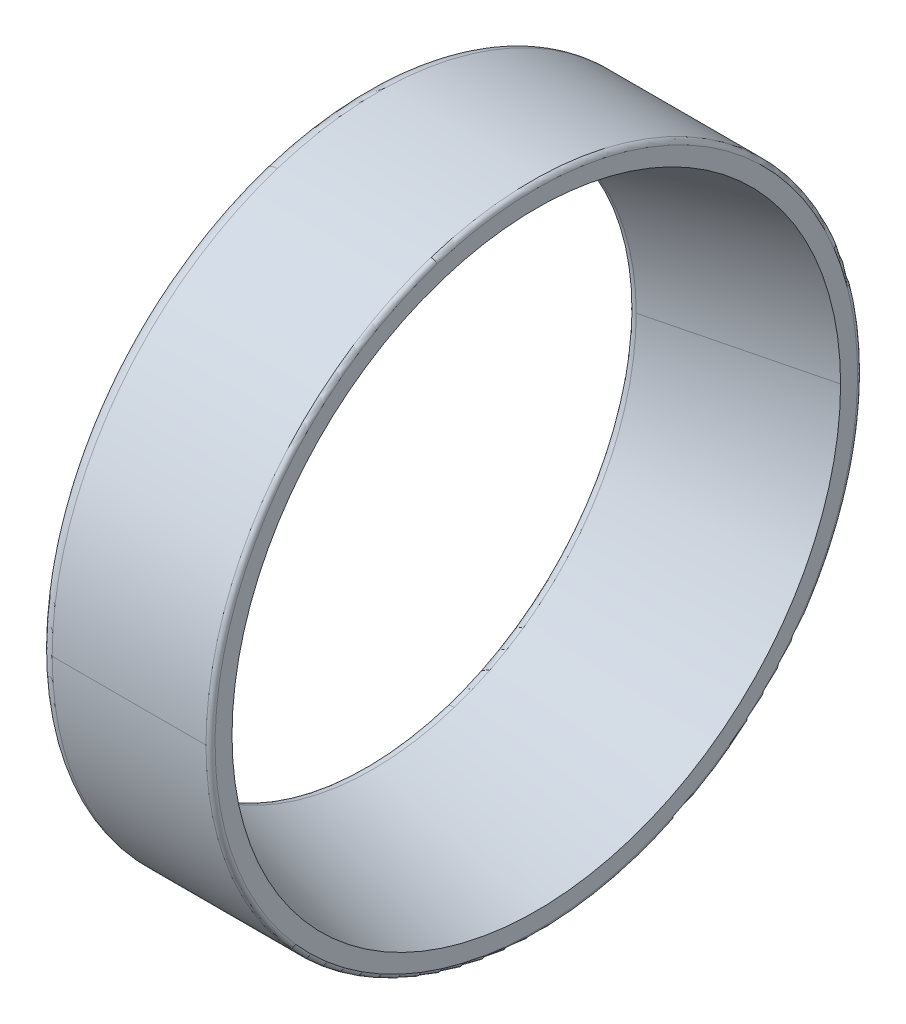
ISO-10303-21;
HEADER;
FILE_DESCRIPTION(('STEP AP214'),'2;1');
FILE_NAME('part.step','',(''),(''),'','','');
FILE_SCHEMA(('AUTOMOTIVE_DESIGN { 1 0 10303 214 1 1 1 1 }'));
ENDSEC;
DATA;
#1=APPLICATION_CONTEXT('core data for automotive mechanical design processes');
#2=APPLICATION_PROTOCOL_DEFINITION('international standard','automotive_design',2000,#1);
#3=PRODUCT_CONTEXT('',#1,'mechanical');
#4=PRODUCT('Part','Part','',(#3));
#5=PRODUCT_RELATED_PRODUCT_CATEGORY('part','',(#4));
#6=PRODUCT_DEFINITION_FORMATION('','',#4);
#7=PRODUCT_DEFINITION_CONTEXT('part definition',#1,'design');
#8=PRODUCT_DEFINITION('design','',#6,#7);
#9=PRODUCT_DEFINITION_SHAPE('','',#8);
#10=(LENGTH_UNIT() NAMED_UNIT(*) SI_UNIT(.MILLI.,.METRE.));
#11=(NAMED_UNIT(*) PLANE_ANGLE_UNIT() SI_UNIT($,.RADIAN.));
#12=(NAMED_UNIT(*) SI_UNIT($,.STERADIAN.) SOLID_ANGLE_UNIT());
#13=UNCERTAINTY_MEASURE_WITH_UNIT(LENGTH_MEASURE(1.E-05),#10,'distance_accuracy_value','');
#14=(GEOMETRIC_REPRESENTATION_CONTEXT(3) GLOBAL_UNCERTAINTY_ASSIGNED_CONTEXT((#13)) GLOBAL_UNIT_ASSIGNED_CONTEXT((#10,
#11,#12)) REPRESENTATION_CONTEXT('',''));
#15=CARTESIAN_POINT('',(0.,0.,0.));
#16=DIRECTION('',(0.,0.,1.));
#17=DIRECTION('',(1.,0.,0.));
#18=AXIS2_PLACEMENT_3D('',#15,#16,#17);
#19=CARTESIAN_POINT('',(0.,34.5,0.));
#20=DIRECTION('',(-1.,0.,0.));
#21=DIRECTION('',(0.,0.,1.));
#22=AXIS2_PLACEMENT_3D('',#19,#20,#21);
#23=PLANE('',#22);
#24=CARTESIAN_POINT('',(0.,0.,0.));
#25=DIRECTION('',(1.,0.,0.));
#26=DIRECTION('',(0.,0.,-1.));
#27=AXIS2_PLACEMENT_3D('',#24,#25,#26);
#28=CIRCLE('',#27,29.835917140552);
#29=CARTESIAN_POINT('',(0.,28.3756434161648,9.21980543919354));
#30=VERTEX_POINT('',#29);
#31=CARTESIAN_POINT('',(0.,-28.3756434161648,-9.21980543919353));
#32=VERTEX_POINT('',#31);
#33=EDGE_CURVE('E11',#30,#32,#28,.T.);
#34=ORIENTED_EDGE('',*,*,#33,.T.);
#35=CARTESIAN_POINT('',(0.,-28.3756434161642,-9.21980543919335));
#36=CARTESIAN_POINT('',(0.,-26.9273409423267,-13.6769993789602));
#37=CARTESIAN_POINT('',(0.,-24.6042309447035,-17.8500900999387));
#38=CARTESIAN_POINT('',(0.,-21.4791720789765,-21.5088667284196));
#39=CARTESIAN_POINT('',(0.,-13.9629095158658,-27.4037424481515));
#40=CARTESIAN_POINT('',(0.,-4.77590062059968,-30.019635684779));
#41=CARTESIAN_POINT('',(0.,0.0209984347427153,-30.3971680078637));
#42=CARTESIAN_POINT('',(0.,9.50410217305697,-29.2506187936491));
#43=CARTESIAN_POINT('',(0.,17.8500189759167,-24.6041680694951));
#44=CARTESIAN_POINT('',(0.,21.5088839002169,-21.4791914827279));
#45=CARTESIAN_POINT('',(0.,27.4037467578997,-13.9629010575086));
#46=CARTESIAN_POINT('',(0.,30.0196098934852,-4.7758981335627));
#47=CARTESIAN_POINT('',(0.,30.3972606806269,0.0209778513204704));
#48=CARTESIAN_POINT('',(0.,29.8238149662367,4.76256895971649));
#49=CARTESIAN_POINT('',(0.,28.3756434161643,9.21980543919335));
#50=B_SPLINE_CURVE_WITH_KNOTS('',5,(#35,#36,#37,#38,#39,#40,#41,#42,#43,#44,#45,#46,#47,#48,
#49),.UNSPECIFIED.,.F.,.F.,(6,3,3,3,6),(0.,0.785398163397448,1.5707963267949,2.35619449019234,
3.14159265358979),.UNSPECIFIED.);
#51=EDGE_CURVE('E26',#32,#30,#50,.T.);
#52=ORIENTED_EDGE('',*,*,#51,.T.);
#53=EDGE_LOOP('',(#34,#52));
#54=FACE_BOUND('',#53,.T.);
#55=CARTESIAN_POINT('',(0.,32.8114498121828,10.6610863059358));
#56=CARTESIAN_POINT('',(0.,32.6370194077504,11.1979666405393));
#57=CARTESIAN_POINT('',(0.,32.4493900248656,11.7305572957197));
#58=CARTESIAN_POINT('',(0.,32.0482345212866,12.7858948926291));
#59=CARTESIAN_POINT('',(0.,31.8347084005924,13.308641834358));
#60=CARTESIAN_POINT('',(0.,31.3822606404899,14.3430276497588));
#61=CARTESIAN_POINT('',(0.,31.1433390010817,14.8546665234307));
#62=CARTESIAN_POINT('',(0.,30.6406793193583,15.8656049626667));
#63=CARTESIAN_POINT('',(0.,30.3769412770432,16.3649045282308));
#64=CARTESIAN_POINT('',(0.,29.8252832109797,17.3499611350593));
#65=CARTESIAN_POINT('',(0.,29.5373631872314,17.8357181763237));
#66=CARTESIAN_POINT('',(0.,28.9380350364906,18.7925195997026));
#67=CARTESIAN_POINT('',(0.,28.6266269094981,19.2635639818171));
#68=CARTESIAN_POINT('',(0.,27.9810726937622,20.1898052738883));
#69=CARTESIAN_POINT('',(0.,27.6469266050188,20.6450021838449));
#70=CARTESIAN_POINT('',(0.,26.9567014711866,21.5384519292956));
#71=CARTESIAN_POINT('',(0.,26.6006224260979,21.9767047647896));
#72=CARTESIAN_POINT('',(0.,25.8673892003041,22.8352105699932));
#73=CARTESIAN_POINT('',(0.,25.4902350195991,23.2554635397028));
#74=CARTESIAN_POINT('',(0.,24.7157601213364,24.0769571876206));
#75=CARTESIAN_POINT('',(0.,24.3184394037787,24.4781978658289));
#76=CARTESIAN_POINT('',(0.,23.5045886118701,25.2607003066726));
#77=CARTESIAN_POINT('',(0.,23.0880585375191,25.6419620693081));
#78=CARTESIAN_POINT('',(0.,22.2367924895506,26.3835881860611));
#79=CARTESIAN_POINT('',(0.,21.8020565159331,26.7439525401786));
#80=CARTESIAN_POINT('',(0.,20.9154259864453,27.4429156905929));
#81=CARTESIAN_POINT('',(0.,20.4635314305749,27.7815144868897));
#82=CARTESIAN_POINT('',(0.,19.5436723901544,28.4361308075071));
#83=CARTESIAN_POINT('',(0.,19.0757079056043,28.7521483318277));
#84=CARTESIAN_POINT('',(0.,18.1248363752546,29.3608407945961));
#85=CARTESIAN_POINT('',(0.,17.641929329455,29.6535157330439));
#86=CARTESIAN_POINT('',(0.,16.662336041978,30.2148179445047));
#87=CARTESIAN_POINT('',(0.,16.1656498003005,30.4834452175178));
#88=CARTESIAN_POINT('',(0.,15.1596946817281,30.9960049514796));
#89=CARTESIAN_POINT('',(0.,14.6504258048333,31.2399374124283));
#90=CARTESIAN_POINT('',(0.,13.6205322891575,31.702519867597));
#91=CARTESIAN_POINT('',(0.,13.0999076503766,31.9211698618169));
#92=CARTESIAN_POINT('',(0.,12.0485568412846,32.3326606365405));
#93=CARTESIAN_POINT('',(0.,11.5178306709737,32.5255014170442));
#94=CARTESIAN_POINT('',(0.,10.4475553646521,32.8849091940041));
#95=CARTESIAN_POINT('',(0.,9.90800622864158,33.0514761904603));
#96=CARTESIAN_POINT('',(0.,8.82138481204843,33.3579351248414));
#97=CARTESIAN_POINT('',(0.,8.27431253146584,33.4978270627662));
#98=CARTESIAN_POINT('',(0.,7.17396277077043,33.7505988681529));
#99=CARTESIAN_POINT('',(0.,6.62068529065761,33.8634787356148));
#100=CARTESIAN_POINT('',(0.,5.50925802481272,34.0619544625878));
#101=CARTESIAN_POINT('',(0.,4.95110823908065,34.1475503220988));
#102=CARTESIAN_POINT('',(0.,3.83128099371924,34.2912518252474));
#103=CARTESIAN_POINT('',(0.,3.26960353408989,34.3493574688848));
#104=CARTESIAN_POINT('',(0.,2.1440740711313,34.437938558701));
#105=CARTESIAN_POINT('',(0.,1.58022206780205,34.4684140048798));
#106=CARTESIAN_POINT('',(0.,0.451701886307285,34.5016612817596));
#107=CARTESIAN_POINT('',(0.,-0.112966291858231,34.5044331124606));
#108=CARTESIAN_POINT('',(0.,-1.24175848792524,34.4822664808019));
#109=CARTESIAN_POINT('',(0.,-1.80588250582674,34.4573280184421));
#110=CARTESIAN_POINT('',(0.,-2.93222735719516,34.379800879602));
#111=CARTESIAN_POINT('',(0.,-3.49444819066209,34.3272122031217));
#112=CARTESIAN_POINT('',(0.,-4.61563223392882,34.1945113267683));
#113=CARTESIAN_POINT('',(0.,-5.17459544372863,34.1143991268952));
#114=CARTESIAN_POINT('',(0.,-6.28791764832931,33.9268442010629));
#115=CARTESIAN_POINT('',(0.,-6.84227664313019,33.8194014751036));
#116=CARTESIAN_POINT('',(0.,-7.94505491835844,33.5774443360366));
#117=CARTESIAN_POINT('',(0.,-8.4934741987858,33.4429299229288));
#118=CARTESIAN_POINT('',(0.,-9.58305185518461,33.147153466568));
#119=CARTESIAN_POINT('',(0.,-10.1242102311561,32.9858914233149));
#120=CARTESIAN_POINT('',(0.,-11.1979623807154,32.6370082010506));
#121=CARTESIAN_POINT('',(0.,-11.7305561543034,32.4493870220394));
#122=CARTESIAN_POINT('',(0.,-12.7858960340455,32.0482375241127));
#123=CARTESIAN_POINT('',(0.,-13.3086421401996,31.8347092051972));
#124=CARTESIAN_POINT('',(0.,-14.3430273439172,31.3822598358851));
#125=CARTESIAN_POINT('',(0.,-14.8546664414807,31.1433387854885));
#126=CARTESIAN_POINT('',(0.,-15.8656050446167,30.6406795349516));
#127=CARTESIAN_POINT('',(0.,-16.3649045501892,30.3769413348112));
#128=CARTESIAN_POINT('',(0.,-17.3499611131008,29.8252831532117));
#129=CARTESIAN_POINT('',(0.,-17.8357181704399,29.5373631717526));
#130=CARTESIAN_POINT('',(0.,-18.7925196055863,28.9380350519696));
#131=CARTESIAN_POINT('',(0.,-19.2635639833936,28.6266269136457));
#132=CARTESIAN_POINT('',(0.,-20.1898052723117,27.9810726896147));
#133=CARTESIAN_POINT('',(0.,-20.6450021834224,27.6469266039075));
#134=CARTESIAN_POINT('',(0.,-21.538451929718,26.956701472298));
#135=CARTESIAN_POINT('',(0.,-21.9767047649028,26.6006224263957));
#136=CARTESIAN_POINT('',(0.,-22.83521056988,25.8673892000064));
#137=CARTESIAN_POINT('',(0.,-23.2554635396724,25.4902350195194));
#138=CARTESIAN_POINT('',(0.,-24.0769571876509,24.7157601214162));
#139=CARTESIAN_POINT('',(0.,-24.478197865837,24.3184394038001));
#140=CARTESIAN_POINT('',(0.,-25.2607003066645,23.5045886118487));
#141=CARTESIAN_POINT('',(0.,-25.6419620693059,23.0880585375134));
#142=CARTESIAN_POINT('',(0.,-26.3835881860632,22.2367924895564));
#143=CARTESIAN_POINT('',(0.,-26.7439525401791,21.8020565159347));
#144=CARTESIAN_POINT('',(0.,-27.4429156905923,20.9154259864438));
#145=CARTESIAN_POINT('',(0.,-27.7815144868896,20.4635314305745));
#146=CARTESIAN_POINT('',(0.,-28.4361308075073,19.5436723901549));
#147=CARTESIAN_POINT('',(0.,-28.7521483318278,19.0757079056044));
#148=CARTESIAN_POINT('',(0.,-29.3608407945961,18.1248363752545));
#149=CARTESIAN_POINT('',(0.,-29.6535157330438,17.6419293294551));
#150=CARTESIAN_POINT('',(0.,-30.2148179445047,16.6623360419781));
#151=CARTESIAN_POINT('',(0.,-30.4834452175178,16.1656498003005));
#152=CARTESIAN_POINT('',(0.,-30.9960049514796,15.1596946817282));
#153=CARTESIAN_POINT('',(0.,-31.2399374124283,14.6504258048334));
#154=CARTESIAN_POINT('',(0.,-31.702519867597,13.6205322891576));
#155=CARTESIAN_POINT('',(0.,-31.9211698618171,13.0999076503766));
#156=CARTESIAN_POINT('',(0.,-32.3326606365404,12.0485568412847));
#157=CARTESIAN_POINT('',(0.,-32.5255014170437,11.5178306709738));
#158=CARTESIAN_POINT('',(0.,-32.8849091940045,10.4475553646521));
#159=CARTESIAN_POINT('',(0.,-33.0514761904619,9.90800622864118));
#160=CARTESIAN_POINT('',(0.,-33.3579351248398,8.82138481204889));
#161=CARTESIAN_POINT('',(0.,-33.4978270627603,8.27431253146748));
#162=CARTESIAN_POINT('',(0.,-33.7505988681588,7.17396277076887));
#163=CARTESIAN_POINT('',(0.,-33.8634787356369,6.62068529065166));
#164=CARTESIAN_POINT('',(0.,-34.0619544625657,5.50925802481875));
#165=CARTESIAN_POINT('',(0.,-34.1475503220165,4.95110823910304));
#166=CARTESIAN_POINT('',(0.,-34.2912518253298,3.83128099369689));
#167=CARTESIAN_POINT('',(0.,-34.3493574691922,3.26960353400645));
#168=CARTESIAN_POINT('',(0.,-34.4379385583936,2.14407407121478));
#169=CARTESIAN_POINT('',(0.,-34.4684140037325,1.58022206811355));
#170=CARTESIAN_POINT('',(0.,-34.501661282907,0.451701885995848));
#171=CARTESIAN_POINT('',(0.,-34.5044331167427,-0.112966293020619));
#172=CARTESIAN_POINT('',(0.,-34.4822664765197,-1.24175848676279));
#173=CARTESIAN_POINT('',(0.,-34.457328002461,-1.80588250148849));
#174=CARTESIAN_POINT('',(0.,-34.3798008955831,-2.93222736153335));
#175=CARTESIAN_POINT('',(0.,-34.3272122627638,-3.49444820685252));
#176=CARTESIAN_POINT('',(0.,-34.1945112671261,-4.61563221773836));
#177=CARTESIAN_POINT('',(0.,-34.1143989043076,-5.17459538330505));
#178=CARTESIAN_POINT('',(0.,-33.9268444236505,-6.28791770875285));
#179=CARTESIAN_POINT('',(0.,-33.8194023058118,-6.84227686863398));
#180=CARTESIAN_POINT('',(0.,-33.5774435053284,-7.94505469285459));
#181=CARTESIAN_POINT('',(0.,-33.4429268226837,-8.49347335719408));
#182=CARTESIAN_POINT('',(0.,-33.147156566813,-9.58305269677627));
#183=CARTESIAN_POINT('',(0.,-32.9859029935871,-10.124213372019));
#184=CARTESIAN_POINT('',(0.,-32.8114498121828,-10.6610863059357));
#185=B_SPLINE_CURVE_WITH_KNOTS('',3,(#55,#56,#57,#58,#59,#60,#61,#62,#63,#64,#65,#66,#67,#68,
#69,#70,#71,#72,#73,#74,#75,#76,#77,#78,#79,#80,#81,#82,#83,#84,#85,#86,#87,#88,#89,#90,#91,#92,
#93,#94,#95,#96,#97,#98,#99,#100,#101,#102,#103,#104,#105,#106,#107,#108,#109,#110,#111,#112,
#113,#114,#115,#116,#117,#118,#119,#120,#121,#122,#123,#124,#125,#126,#127,#128,#129,#130,#131,
#132,#133,#134,#135,#136,#137,#138,#139,#140,#141,#142,#143,#144,#145,#146,#147,#148,#149,#150,
#151,#152,#153,#154,#155,#156,#157,#158,#159,#160,#161,#162,#163,#164,#165,#166,#167,#168,#169,
#170,#171,#172,#173,#174,#175,#176,#177,#178,#179,#180,#181,#182,#183,#184),.UNSPECIFIED.,.F.,
.F.,(4,2,2,2,2,2,2,2,2,2,2,2,2,2,2,2,2,2,2,2,2,2,2,2,2,2,2,2,2,2,2,2,2,2,2,2,2,2,2,2,2,2,2,2,2,
2,2,2,2,2,2,2,2,2,2,2,2,2,2,2,2,2,2,2,4),(0.,1.69334476808094,3.38668953616189,5.08003430424284,
6.77337907232379,8.46672384040474,10.1600686084857,11.8534133765666,13.5467581446476,
15.2401029127285,16.9334476808095,18.6267924488904,20.3201372169714,22.0134819850523,
23.7068267531333,25.4001715212142,27.0935162892952,28.7868610573761,30.4802058254571,
32.173550593538,33.8668953616189,35.5602401296999,37.2535848977808,38.9469296658618,
40.6402744339427,42.3336192020237,44.0269639701046,45.7203087381856,47.4136535062665,
49.1069982743475,50.8003430424284,52.4936878105094,54.1870325785903,55.8803773466713,
57.5737221147522,59.2670668828332,60.9604116509141,62.6537564189951,64.347101187076,
66.040445955157,67.7337907232379,69.4271354913189,71.1204802593998,72.8138250274808,
74.5071697955617,76.2005145636427,77.8938593317236,79.5872040998046,81.2805488678855,
82.9738936359664,84.6672384040474,86.3605831721283,88.0539279402093,89.7472727082902,
91.4406174763712,93.1339622444521,94.8273070125331,96.520651780614,98.213996548695,
99.9073413167759,101.600686084857,103.294030852938,104.987375621019,106.6807203891,
108.374065157181),.UNSPECIFIED.);
#186=CARTESIAN_POINT('',(0.,32.8114498121828,10.6610863059357));
#187=VERTEX_POINT('',#186);
#188=CARTESIAN_POINT('',(0.,-32.8114498121828,-10.6610863059357));
#189=VERTEX_POINT('',#188);
#190=EDGE_CURVE('E200',#187,#189,#185,.T.);
#191=ORIENTED_EDGE('',*,*,#190,.F.);
#192=CARTESIAN_POINT('',(0.,-32.8114498121828,-10.6610863059358));
#193=CARTESIAN_POINT('',(0.,-32.6370194077504,-11.1979666405393));
#194=CARTESIAN_POINT('',(0.,-32.4493900248656,-11.7305572957197));
#195=CARTESIAN_POINT('',(0.,-32.0482345212866,-12.7858948926291));
#196=CARTESIAN_POINT('',(0.,-31.8347084005924,-13.308641834358));
#197=CARTESIAN_POINT('',(0.,-31.3822606404899,-14.3430276497588));
#198=CARTESIAN_POINT('',(0.,-31.1433390010817,-14.8546665234307));
#199=CARTESIAN_POINT('',(0.,-30.6406793193583,-15.8656049626667));
#200=CARTESIAN_POINT('',(0.,-30.3769412770432,-16.3649045282308));
#201=CARTESIAN_POINT('',(0.,-29.8252832109797,-17.3499611350593));
#202=CARTESIAN_POINT('',(0.,-29.5373631872315,-17.8357181763237));
#203=CARTESIAN_POINT('',(0.,-28.9380350364906,-18.7925195997026));
#204=CARTESIAN_POINT('',(0.,-28.6266269094981,-19.2635639818171));
#205=CARTESIAN_POINT('',(0.,-27.9810726937622,-20.1898052738883));
#206=CARTESIAN_POINT('',(0.,-27.6469266050188,-20.6450021838449));
#207=CARTESIAN_POINT('',(0.,-26.9567014711867,-21.5384519292956));
#208=CARTESIAN_POINT('',(0.,-26.6006224260979,-21.9767047647896));
#209=CARTESIAN_POINT('',(0.,-25.8673892003041,-22.8352105699932));
#210=CARTESIAN_POINT('',(0.,-25.4902350195991,-23.2554635397028));
#211=CARTESIAN_POINT('',(0.,-24.7157601213364,-24.0769571876206));
#212=CARTESIAN_POINT('',(0.,-24.3184394037787,-24.4781978658289));
#213=CARTESIAN_POINT('',(0.,-23.5045886118701,-25.2607003066726));
#214=CARTESIAN_POINT('',(0.,-23.0880585375191,-25.641962069308));
#215=CARTESIAN_POINT('',(0.,-22.2367924895507,-26.383588186061));
#216=CARTESIAN_POINT('',(0.,-21.8020565159332,-26.7439525401786));
#217=CARTESIAN_POINT('',(0.,-20.9154259864453,-27.4429156905929));
#218=CARTESIAN_POINT('',(0.,-20.4635314305749,-27.7815144868897));
#219=CARTESIAN_POINT('',(0.,-19.5436723901544,-28.4361308075071));
#220=CARTESIAN_POINT('',(0.,-19.0757079056043,-28.7521483318277));
#221=CARTESIAN_POINT('',(0.,-18.1248363752546,-29.3608407945961));
#222=CARTESIAN_POINT('',(0.,-17.6419293294551,-29.6535157330439));
#223=CARTESIAN_POINT('',(0.,-16.662336041978,-30.2148179445047));
#224=CARTESIAN_POINT('',(0.,-16.1656498003005,-30.4834452175178));
#225=CARTESIAN_POINT('',(0.,-15.1596946817282,-30.9960049514796));
#226=CARTESIAN_POINT('',(0.,-14.6504258048334,-31.2399374124283));
#227=CARTESIAN_POINT('',(0.,-13.6205322891576,-31.702519867597));
#228=CARTESIAN_POINT('',(0.,-13.0999076503766,-31.9211698618169));
#229=CARTESIAN_POINT('',(0.,-12.0485568412847,-32.3326606365405));
#230=CARTESIAN_POINT('',(0.,-11.5178306709737,-32.5255014170442));
#231=CARTESIAN_POINT('',(0.,-10.4475553646522,-32.8849091940041));
#232=CARTESIAN_POINT('',(0.,-9.90800622864161,-33.0514761904603));
#233=CARTESIAN_POINT('',(0.,-8.82138481204846,-33.3579351248414));
#234=CARTESIAN_POINT('',(0.,-8.27431253146587,-33.4978270627662));
#235=CARTESIAN_POINT('',(0.,-7.17396277077047,-33.7505988681529));
#236=CARTESIAN_POINT('',(0.,-6.62068529065766,-33.8634787356148));
#237=CARTESIAN_POINT('',(0.,-5.50925802481277,-34.0619544625877));
#238=CARTESIAN_POINT('',(0.,-4.9511082390807,-34.1475503220988));
#239=CARTESIAN_POINT('',(0.,-3.83128099371929,-34.2912518252474));
#240=CARTESIAN_POINT('',(0.,-3.26960353408994,-34.3493574688848));
#241=CARTESIAN_POINT('',(0.,-2.14407407113134,-34.437938558701));
#242=CARTESIAN_POINT('',(0.,-1.58022206780209,-34.4684140048798));
#243=CARTESIAN_POINT('',(0.,-0.451701886307324,-34.5016612817596));
#244=CARTESIAN_POINT('',(0.,0.112966291858186,-34.5044331124606));
#245=CARTESIAN_POINT('',(0.,1.24175848792519,-34.4822664808019));
#246=CARTESIAN_POINT('',(0.,1.80588250582669,-34.4573280184421));
#247=CARTESIAN_POINT('',(0.,2.93222735719511,-34.379800879602));
#248=CARTESIAN_POINT('',(0.,3.49444819066203,-34.3272122031217));
#249=CARTESIAN_POINT('',(0.,4.61563223392876,-34.1945113267683));
#250=CARTESIAN_POINT('',(0.,5.17459544372856,-34.1143991268952));
#251=CARTESIAN_POINT('',(0.,6.28791764832925,-33.9268442010629));
#252=CARTESIAN_POINT('',(0.,6.84227664313013,-33.8194014751036));
#253=CARTESIAN_POINT('',(0.,7.94505491835837,-33.5774443360366));
#254=CARTESIAN_POINT('',(0.,8.49347419878574,-33.4429299229288));
#255=CARTESIAN_POINT('',(0.,9.58305185518454,-33.147153466568));
#256=CARTESIAN_POINT('',(0.,10.124210231156,-32.9858914233149));
#257=CARTESIAN_POINT('',(0.,11.1979623807154,-32.6370082010507));
#258=CARTESIAN_POINT('',(0.,11.7305561543033,-32.4493870220395));
#259=CARTESIAN_POINT('',(0.,12.7858960340454,-32.0482375241127));
#260=CARTESIAN_POINT('',(0.,13.3086421401995,-31.8347092051972));
#261=CARTESIAN_POINT('',(0.,14.3430273439172,-31.3822598358851));
#262=CARTESIAN_POINT('',(0.,14.8546664414807,-31.1433387854885));
#263=CARTESIAN_POINT('',(0.,15.8656050446166,-30.6406795349516));
#264=CARTESIAN_POINT('',(0.,16.3649045501891,-30.3769413348113));
#265=CARTESIAN_POINT('',(0.,17.3499611131007,-29.8252831532118));
#266=CARTESIAN_POINT('',(0.,17.8357181704398,-29.5373631717526));
#267=CARTESIAN_POINT('',(0.,18.7925196055863,-28.9380350519696));
#268=CARTESIAN_POINT('',(0.,19.2635639833936,-28.6266269136458));
#269=CARTESIAN_POINT('',(0.,20.1898052723116,-27.9810726896147));
#270=CARTESIAN_POINT('',(0.,20.6450021834224,-27.6469266039075));
#271=CARTESIAN_POINT('',(0.,21.5384519297179,-26.9567014722981));
#272=CARTESIAN_POINT('',(0.,21.9767047649027,-26.6006224263957));
#273=CARTESIAN_POINT('',(0.,22.8352105698799,-25.8673892000064));
#274=CARTESIAN_POINT('',(0.,23.2554635396724,-25.4902350195194));
#275=CARTESIAN_POINT('',(0.,24.0769571876509,-24.7157601214163));
#276=CARTESIAN_POINT('',(0.,24.4781978658369,-24.3184394038002));
#277=CARTESIAN_POINT('',(0.,25.2607003066644,-23.5045886118488));
#278=CARTESIAN_POINT('',(0.,25.6419620693058,-23.0880585375135));
#279=CARTESIAN_POINT('',(0.,26.3835881860631,-22.2367924895565));
#280=CARTESIAN_POINT('',(0.,26.7439525401791,-21.8020565159348));
#281=CARTESIAN_POINT('',(0.,27.4429156905923,-20.9154259864438));
#282=CARTESIAN_POINT('',(0.,27.7815144868895,-20.4635314305746));
#283=CARTESIAN_POINT('',(0.,28.4361308075072,-19.5436723901549));
#284=CARTESIAN_POINT('',(0.,28.7521483318277,-19.0757079056045));
#285=CARTESIAN_POINT('',(0.,29.360840794596,-18.1248363752546));
#286=CARTESIAN_POINT('',(0.,29.6535157330438,-17.6419293294551));
#287=CARTESIAN_POINT('',(0.,30.2148179445047,-16.6623360419781));
#288=CARTESIAN_POINT('',(0.,30.4834452175178,-16.1656498003006));
#289=CARTESIAN_POINT('',(0.,30.9960049514796,-15.1596946817283));
#290=CARTESIAN_POINT('',(0.,31.2399374124283,-14.6504258048334));
#291=CARTESIAN_POINT('',(0.,31.702519867597,-13.6205322891576));
#292=CARTESIAN_POINT('',(0.,31.921169861817,-13.0999076503766));
#293=CARTESIAN_POINT('',(0.,32.3326606365404,-12.0485568412848));
#294=CARTESIAN_POINT('',(0.,32.5255014170437,-11.5178306709739));
#295=CARTESIAN_POINT('',(0.,32.8849091940045,-10.4475553646521));
#296=CARTESIAN_POINT('',(0.,33.0514761904619,-9.90800622864127));
#297=CARTESIAN_POINT('',(0.,33.3579351248398,-8.82138481204898));
#298=CARTESIAN_POINT('',(0.,33.4978270627603,-8.27431253146757));
#299=CARTESIAN_POINT('',(0.,33.7505988681588,-7.17396277076896));
#300=CARTESIAN_POINT('',(0.,33.8634787356368,-6.62068529065176));
#301=CARTESIAN_POINT('',(0.,34.0619544625657,-5.50925802481886));
#302=CARTESIAN_POINT('',(0.,34.1475503220164,-4.95110823910316));
#303=CARTESIAN_POINT('',(0.,34.2912518253297,-3.83128099369702));
#304=CARTESIAN_POINT('',(0.,34.3493574691922,-3.26960353400658));
#305=CARTESIAN_POINT('',(0.,34.4379385583936,-2.1440740712149));
#306=CARTESIAN_POINT('',(0.,34.4684140037324,-1.58022206811367));
#307=CARTESIAN_POINT('',(0.,34.501661282907,-0.451701885995974));
#308=CARTESIAN_POINT('',(0.,34.5044331167427,0.112966293020492));
#309=CARTESIAN_POINT('',(0.,34.4822664765197,1.24175848676266));
#310=CARTESIAN_POINT('',(0.,34.457328002461,1.80588250148836));
#311=CARTESIAN_POINT('',(0.,34.3798008955831,2.93222736153323));
#312=CARTESIAN_POINT('',(0.,34.3272122627638,3.49444820685239));
#313=CARTESIAN_POINT('',(0.,34.1945112671261,4.61563221773824));
#314=CARTESIAN_POINT('',(0.,34.1143989043076,5.17459538330492));
#315=CARTESIAN_POINT('',(0.,33.9268444236505,6.28791770875273));
#316=CARTESIAN_POINT('',(0.,33.8194023058118,6.84227686863386));
#317=CARTESIAN_POINT('',(0.,33.5774435053284,7.94505469285447));
#318=CARTESIAN_POINT('',(0.,33.4429268226838,8.49347335719395));
#319=CARTESIAN_POINT('',(0.,33.1471565668131,9.58305269677614));
#320=CARTESIAN_POINT('',(0.,32.9859029935871,10.1242133720188));
#321=CARTESIAN_POINT('',(0.,32.8114498121828,10.6610863059356));
#322=B_SPLINE_CURVE_WITH_KNOTS('',3,(#192,#193,#194,#195,#196,#197,#198,#199,#200,#201,#202,
#203,#204,#205,#206,#207,#208,#209,#210,#211,#212,#213,#214,#215,#216,#217,#218,#219,#220,#221,
#222,#223,#224,#225,#226,#227,#228,#229,#230,#231,#232,#233,#234,#235,#236,#237,#238,#239,#240,
#241,#242,#243,#244,#245,#246,#247,#248,#249,#250,#251,#252,#253,#254,#255,#256,#257,#258,#259,
#260,#261,#262,#263,#264,#265,#266,#267,#268,#269,#270,#271,#272,#273,#274,#275,#276,#277,#278,
#279,#280,#281,#282,#283,#284,#285,#286,#287,#288,#289,#290,#291,#292,#293,#294,#295,#296,#297,
#298,#299,#300,#301,#302,#303,#304,#305,#306,#307,#308,#309,#310,#311,#312,#313,#314,#315,#316,
#317,#318,#319,#320,#321),.UNSPECIFIED.,.F.,.F.,(4,2,2,2,2,2,2,2,2,2,2,2,2,2,2,2,2,2,2,2,2,2,2,
2,2,2,2,2,2,2,2,2,2,2,2,2,2,2,2,2,2,2,2,2,2,2,2,2,2,2,2,2,2,2,2,2,2,2,2,2,2,2,2,2,4),(0.,
1.69334476808094,3.38668953616189,5.08003430424283,6.77337907232379,8.46672384040473,
10.1600686084857,11.8534133765666,13.5467581446476,15.2401029127285,16.9334476808095,
18.6267924488904,20.3201372169713,22.0134819850523,23.7068267531332,25.4001715212142,
27.0935162892951,28.7868610573761,30.480205825457,32.173550593538,33.8668953616189,
35.5602401296998,37.2535848977808,38.9469296658617,40.6402744339427,42.3336192020236,
44.0269639701046,45.7203087381855,47.4136535062665,49.1069982743474,50.8003430424284,
52.4936878105093,54.1870325785902,55.8803773466712,57.5737221147521,59.2670668828331,
60.960411650914,62.653756418995,64.3471011870759,66.0404459551569,67.7337907232378,
69.4271354913188,71.1204802593997,72.8138250274806,74.5071697955616,76.2005145636425,
77.8938593317235,79.5872040998044,81.2805488678854,82.9738936359663,84.6672384040473,
86.3605831721282,88.0539279402091,89.7472727082901,91.440617476371,93.133962244452,
94.8273070125329,96.5206517806139,98.2139965486948,99.9073413167758,101.600686084857,
103.294030852938,104.987375621019,106.6807203891,108.374065157181),.UNSPECIFIED.);
#323=EDGE_CURVE('E301',#189,#187,#322,.T.);
#324=ORIENTED_EDGE('',*,*,#323,.F.);
#325=EDGE_LOOP('',(#191,#324));
#326=FACE_BOUND('',#325,.T.);
#327=ADVANCED_FACE('F17',(#54,#326),#23,.T.);
#328=CARTESIAN_POINT('',(1.4999999999997,0.,0.));
#329=DIRECTION('',(1.,0.,0.));
#330=DIRECTION('',(0.,-0.309016994374947,0.951056516295154));
#331=AXIS2_PLACEMENT_3D('',#328,#329,#330);
#332=TOROIDAL_SURFACE('',#331,34.5,1.4999999999997);
#333=CARTESIAN_POINT('',(1.4999999999997,-32.8114498121828,-10.6610863059357));
#334=DIRECTION('',(0.,0.309016994374948,-0.951056516295153));
#335=DIRECTION('',(1.97471668646701E-13,-0.951056516295153,-0.309016994374948));
#336=AXIS2_PLACEMENT_3D('',#333,#334,#335);
#337=CIRCLE('',#336,1.49999999999969);
#338=CARTESIAN_POINT('',(1.5,-34.2380345866252,-11.124611797498));
#339=VERTEX_POINT('',#338);
#340=EDGE_CURVE('E264',#339,#189,#337,.T.);
#341=ORIENTED_EDGE('',*,*,#340,.T.);
#342=ORIENTED_EDGE('',*,*,#323,.T.);
#343=CARTESIAN_POINT('',(1.4999999999997,32.8114498121828,10.6610863059357));
#344=DIRECTION('',(0.,-0.309016994374948,0.951056516295153));
#345=DIRECTION('',(1.99248025486102E-13,0.951056516295153,0.309016994374948));
#346=AXIS2_PLACEMENT_3D('',#343,#344,#345);
#347=CIRCLE('',#346,1.49999999999969);
#348=CARTESIAN_POINT('',(1.5,34.2380345866252,11.124611797498));
#349=VERTEX_POINT('',#348);
#350=EDGE_CURVE('E260',#349,#187,#347,.T.);
#351=ORIENTED_EDGE('',*,*,#350,.F.);
#352=CARTESIAN_POINT('',(1.5,0.,0.));
#353=DIRECTION('',(1.,0.,0.));
#354=DIRECTION('',(0.,0.,-1.));
#355=AXIS2_PLACEMENT_3D('',#352,#353,#354);
#356=CIRCLE('',#355,36.);
#357=CARTESIAN_POINT('',(1.5,0.,-36.));
#358=VERTEX_POINT('',#357);
#359=EDGE_CURVE('E255',#358,#349,#356,.T.);
#360=ORIENTED_EDGE('',*,*,#359,.F.);
#361=CARTESIAN_POINT('',(1.5,0.,0.));
#362=DIRECTION('',(1.,0.,0.));
#363=DIRECTION('',(0.,0.,-1.));
#364=AXIS2_PLACEMENT_3D('',#361,#362,#363);
#365=CIRCLE('',#364,36.);
#366=EDGE_CURVE('E250',#339,#358,#365,.T.);
#367=ORIENTED_EDGE('',*,*,#366,.F.);
#368=EDGE_LOOP('',(#341,#342,#351,#360,#367));
#369=FACE_BOUND('',#368,.T.);
#370=ADVANCED_FACE('F272',(#369),#332,.T.);
#371=CARTESIAN_POINT('',(19.,0.,0.));
#372=DIRECTION('',(1.,0.,0.));
#373=DIRECTION('',(0.,1.,0.));
#374=AXIS2_PLACEMENT_3D('',#371,#372,#373);
#375=CYLINDRICAL_SURFACE('',#374,36.);
#376=DIRECTION('',(1.,0.,0.));
#377=VECTOR('',#376,1.);
#378=CARTESIAN_POINT('',(1.5,0.,36.));
#379=LINE('',#378,#377);
#380=CARTESIAN_POINT('',(1.5,0.,36.));
#381=VERTEX_POINT('',#380);
#382=CARTESIAN_POINT('',(18.5,0.,36.));
#383=VERTEX_POINT('',#382);
#384=EDGE_CURVE('E245',#381,#383,#379,.T.);
#385=ORIENTED_EDGE('',*,*,#384,.F.);
#386=CARTESIAN_POINT('',(1.5,0.,0.));
#387=DIRECTION('',(1.,0.,0.));
#388=DIRECTION('',(0.,0.,-1.));
#389=AXIS2_PLACEMENT_3D('',#386,#387,#388);
#390=CIRCLE('',#389,36.);
#391=EDGE_CURVE('E240',#381,#339,#390,.T.);
#392=ORIENTED_EDGE('',*,*,#391,.T.);
#393=ORIENTED_EDGE('',*,*,#366,.T.);
#394=DIRECTION('',(1.,0.,0.));
#395=VECTOR('',#394,1.);
#396=CARTESIAN_POINT('',(1.5,0.,-36.));
#397=LINE('',#396,#395);
#398=CARTESIAN_POINT('',(18.5,0.,-36.));
#399=VERTEX_POINT('',#398);
#400=EDGE_CURVE('E236',#358,#399,#397,.T.);
#401=ORIENTED_EDGE('',*,*,#400,.T.);
#402=CARTESIAN_POINT('',(18.5,0.,0.));
#403=DIRECTION('',(1.,0.,0.));
#404=DIRECTION('',(0.,0.,-1.));
#405=AXIS2_PLACEMENT_3D('',#402,#403,#404);
#406=CIRCLE('',#405,36.);
#407=CARTESIAN_POINT('',(18.5,-34.2380345866255,-11.1246117974981));
#408=VERTEX_POINT('',#407);
#409=EDGE_CURVE('E231',#408,#399,#406,.T.);
#410=ORIENTED_EDGE('',*,*,#409,.F.);
#411=CARTESIAN_POINT('',(18.5,0.,0.));
#412=DIRECTION('',(1.,0.,0.));
#413=DIRECTION('',(0.,0.,-1.));
#414=AXIS2_PLACEMENT_3D('',#411,#412,#413);
#415=CIRCLE('',#414,36.);
#416=EDGE_CURVE('E226',#383,#408,#415,.T.);
#417=ORIENTED_EDGE('',*,*,#416,.F.);
#418=EDGE_LOOP('',(#385,#392,#393,#401,#410,#417));
#419=FACE_BOUND('',#418,.T.);
#420=ADVANCED_FACE('F281',(#419),#375,.T.);
#421=CARTESIAN_POINT('',(18.499999999999,0.,0.));
#422=DIRECTION('',(1.,0.,0.));
#423=DIRECTION('',(0.,0.309016994374947,-0.951056516295154));
#424=AXIS2_PLACEMENT_3D('',#421,#422,#423);
#425=TOROIDAL_SURFACE('',#424,35.4999999999991,0.500000000000941);
#426=CARTESIAN_POINT('',(18.499999999999,-33.7625063284771,-10.9701033003103));
#427=DIRECTION('',(0.,0.309016994374947,-0.951056516295154));
#428=DIRECTION('',(1.,0.,0.));
#429=AXIS2_PLACEMENT_3D('',#426,#427,#428);
#430=CIRCLE('',#429,0.500000000000941);
#431=CARTESIAN_POINT('',(19.,-33.7625063284771,-10.9701033003103));
#432=VERTEX_POINT('',#431);
#433=EDGE_CURVE('E222',#432,#408,#430,.T.);
#434=ORIENTED_EDGE('',*,*,#433,.F.);
#435=CARTESIAN_POINT('',(19.,0.,0.));
#436=DIRECTION('',(1.,0.,0.));
#437=DIRECTION('',(0.,0.,-1.));
#438=AXIS2_PLACEMENT_3D('',#435,#436,#437);
#439=CIRCLE('',#438,35.5);
#440=CARTESIAN_POINT('',(19.,33.7625063284771,10.9701033003103));
#441=VERTEX_POINT('',#440);
#442=EDGE_CURVE('E218',#441,#432,#439,.T.);
#443=ORIENTED_EDGE('',*,*,#442,.F.);
#444=CARTESIAN_POINT('',(18.499999999999,33.7625063284771,10.9701033003103));
#445=DIRECTION('',(0.,-0.309016994374947,0.951056516295154));
#446=DIRECTION('',(1.,0.,0.));
#447=AXIS2_PLACEMENT_3D('',#444,#445,#446);
#448=CIRCLE('',#447,0.500000000000941);
#449=CARTESIAN_POINT('',(18.5,34.2380345866255,11.1246117974981));
#450=VERTEX_POINT('',#449);
#451=EDGE_CURVE('E214',#441,#450,#448,.T.);
#452=ORIENTED_EDGE('',*,*,#451,.T.);
#453=CARTESIAN_POINT('',(18.5,0.,0.));
#454=DIRECTION('',(1.,0.,0.));
#455=DIRECTION('',(0.,0.,-1.));
#456=AXIS2_PLACEMENT_3D('',#453,#454,#455);
#457=CIRCLE('',#456,36.);
#458=EDGE_CURVE('E209',#450,#383,#457,.T.);
#459=ORIENTED_EDGE('',*,*,#458,.T.);
#460=ORIENTED_EDGE('',*,*,#416,.T.);
#461=EDGE_LOOP('',(#434,#443,#452,#459,#460));
#462=FACE_BOUND('',#461,.T.);
#463=ADVANCED_FACE('F285',(#462),#425,.T.);
#464=CARTESIAN_POINT('',(19.,0.,0.));
#465=DIRECTION('',(1.,0.,0.));
#466=DIRECTION('',(0.,-1.,0.));
#467=AXIS2_PLACEMENT_3D('',#464,#465,#466);
#468=CYLINDRICAL_SURFACE('',#467,36.);
#469=ORIENTED_EDGE('',*,*,#384,.T.);
#470=ORIENTED_EDGE('',*,*,#458,.F.);
#471=CARTESIAN_POINT('',(18.5,0.,0.));
#472=DIRECTION('',(1.,0.,0.));
#473=DIRECTION('',(0.,0.,-1.));
#474=AXIS2_PLACEMENT_3D('',#471,#472,#473);
#475=CIRCLE('',#474,36.);
#476=EDGE_CURVE('E204',#399,#450,#475,.T.);
#477=ORIENTED_EDGE('',*,*,#476,.F.);
#478=ORIENTED_EDGE('',*,*,#400,.F.);
#479=ORIENTED_EDGE('',*,*,#359,.T.);
#480=CARTESIAN_POINT('',(1.5,0.,0.));
#481=DIRECTION('',(1.,0.,0.));
#482=DIRECTION('',(0.,0.,-1.));
#483=AXIS2_PLACEMENT_3D('',#480,#481,#482);
#484=CIRCLE('',#483,36.);
#485=EDGE_CURVE('E201',#349,#381,#484,.T.);
#486=ORIENTED_EDGE('',*,*,#485,.T.);
#487=EDGE_LOOP('',(#469,#470,#477,#478,#479,#486));
#488=FACE_BOUND('',#487,.T.);
#489=ADVANCED_FACE('F288',(#488),#468,.T.);
#490=CARTESIAN_POINT('',(1.4999999999997,0.,0.));
#491=DIRECTION('',(1.,0.,0.));
#492=DIRECTION('',(0.,0.309016994374947,-0.951056516295154));
#493=AXIS2_PLACEMENT_3D('',#490,#491,#492);
#494=TOROIDAL_SURFACE('',#493,34.5,1.4999999999997);
#495=ORIENTED_EDGE('',*,*,#340,.F.);
#496=ORIENTED_EDGE('',*,*,#391,.F.);
#497=ORIENTED_EDGE('',*,*,#485,.F.);
#498=ORIENTED_EDGE('',*,*,#350,.T.);
#499=ORIENTED_EDGE('',*,*,#190,.T.);
#500=EDGE_LOOP('',(#495,#496,#497,#498,#499));
#501=FACE_BOUND('',#500,.T.);
#502=ADVANCED_FACE('F170',(#501),#494,.T.);
#503=CARTESIAN_POINT('',(18.499999999999,0.,0.));
#504=DIRECTION('',(1.,0.,0.));
#505=DIRECTION('',(0.,-0.309016994374947,0.951056516295154));
#506=AXIS2_PLACEMENT_3D('',#503,#504,#505);
#507=TOROIDAL_SURFACE('',#506,35.4999999999991,0.500000000000941);
#508=ORIENTED_EDGE('',*,*,#433,.T.);
#509=ORIENTED_EDGE('',*,*,#409,.T.);
#510=ORIENTED_EDGE('',*,*,#476,.T.);
#511=ORIENTED_EDGE('',*,*,#451,.F.);
#512=CARTESIAN_POINT('',(19.,-33.762506328478,-10.9701033003106));
#513=CARTESIAN_POINT('',(19.,-32.0392565426903,-16.2734557702993));
#514=CARTESIAN_POINT('',(19.,-29.2751248242945,-21.2387705584068));
#515=CARTESIAN_POINT('',(19.,-25.5568013951644,-25.592133309054));
#516=CARTESIAN_POINT('',(19.,-16.613643397592,-32.6060986269175));
#517=CARTESIAN_POINT('',(19.,-5.6825627726674,-35.7185958718593));
#518=CARTESIAN_POINT('',(19.,0.0249848003617548,-36.1677993404963));
#519=CARTESIAN_POINT('',(19.,11.3083712343786,-34.8035879803135));
#520=CARTESIAN_POINT('',(19.,21.2386859321235,-29.2750500127887));
#521=CARTESIAN_POINT('',(19.,25.592153740764,-25.5568244825449));
#522=CARTESIAN_POINT('',(19.,32.606103754833,-16.6136333334911));
#523=CARTESIAN_POINT('',(19.,35.7185651843182,-5.68255981348859));
#524=CARTESIAN_POINT('',(19.,36.1679096063574,0.0249603093603135));
#525=CARTESIAN_POINT('',(19.,35.4856003357909,5.66670021482729));
#526=CARTESIAN_POINT('',(19.,33.762506328478,10.9701033003106));
#527=B_SPLINE_CURVE_WITH_KNOTS('',5,(#512,#513,#514,#515,#516,#517,#518,#519,#520,#521,#522,
#523,#524,#525,#526),.UNSPECIFIED.,.F.,.F.,(6,3,3,3,6),(0.,0.785398163397448,1.5707963267949,
2.35619449019234,3.14159265358979),.UNSPECIFIED.);
#528=EDGE_CURVE('E144',#432,#441,#527,.T.);
#529=ORIENTED_EDGE('',*,*,#528,.F.);
#530=EDGE_LOOP('',(#508,#509,#510,#511,#529));
#531=FACE_BOUND('',#530,.T.);
#532=ADVANCED_FACE('F164',(#531),#507,.T.);
#533=CARTESIAN_POINT('',(19.,33.625253260185,0.));
#534=DIRECTION('',(1.,0.,0.));
#535=DIRECTION('',(0.,0.,-1.));
#536=AXIS2_PLACEMENT_3D('',#533,#534,#535);
#537=PLANE('',#536);
#538=ORIENTED_EDGE('',*,*,#442,.T.);
#539=ORIENTED_EDGE('',*,*,#528,.T.);
#540=EDGE_LOOP('',(#538,#539));
#541=FACE_BOUND('',#540,.T.);
#542=CARTESIAN_POINT('',(19.,0.,0.));
#543=DIRECTION('',(1.,0.,0.));
#544=DIRECTION('',(0.,0.,-1.));
#545=AXIS2_PLACEMENT_3D('',#542,#543,#544);
#546=CIRCLE('',#545,33.625253260185);
#547=CARTESIAN_POINT('',(19.,0.,33.625253260185));
#548=VERTEX_POINT('',#547);
#549=CARTESIAN_POINT('',(19.,0.,-33.625253260185));
#550=VERTEX_POINT('',#549);
#551=EDGE_CURVE('E140',#548,#550,#546,.T.);
#552=ORIENTED_EDGE('',*,*,#551,.F.);
#553=CARTESIAN_POINT('',(19.,0.,0.));
#554=DIRECTION('',(1.,0.,0.));
#555=DIRECTION('',(0.,0.,-1.));
#556=AXIS2_PLACEMENT_3D('',#553,#554,#555);
#557=CIRCLE('',#556,33.625253260185);
#558=EDGE_CURVE('E135',#550,#548,#557,.T.);
#559=ORIENTED_EDGE('',*,*,#558,.F.);
#560=EDGE_LOOP('',(#552,#559));
#561=FACE_BOUND('',#560,.T.);
#562=ADVANCED_FACE('F153',(#541,#561),#537,.T.);
#563=CARTESIAN_POINT('',(0.93189862694339,0.,0.));
#564=DIRECTION('',(1.,0.,0.));
#565=DIRECTION('',(0.,-1.,0.));
#566=AXIS2_PLACEMENT_3D('',#563,#564,#565);
#567=CONICAL_SURFACE('',#566,29.108309492491,0.244974413809951);
#568=DIRECTION('',(0.970143530747307,0.,0.242531502591209));
#569=VECTOR('',#568,1.);
#570=CARTESIAN_POINT('',(0.931898626943369,0.,29.108309492491));
#571=LINE('',#570,#569);
#572=CARTESIAN_POINT('',(0.931898626943369,0.,29.108309492491));
#573=VERTEX_POINT('',#572);
#574=EDGE_CURVE('E131',#573,#548,#571,.T.);
#575=ORIENTED_EDGE('',*,*,#574,.F.);
#576=CARTESIAN_POINT('',(0.93189862694339,0.,0.));
#577=DIRECTION('',(1.,0.,0.));
#578=DIRECTION('',(0.,0.,-1.));
#579=AXIS2_PLACEMENT_3D('',#576,#577,#578);
#580=CIRCLE('',#579,29.108309492491);
#581=CARTESIAN_POINT('',(0.931898626943391,27.6836474211696,8.99496231070532));
#582=VERTEX_POINT('',#581);
#583=EDGE_CURVE('E114',#582,#573,#580,.T.);
#584=ORIENTED_EDGE('',*,*,#583,.F.);
#585=CARTESIAN_POINT('',(0.93189862694339,0.,0.));
#586=DIRECTION('',(1.,0.,0.));
#587=DIRECTION('',(0.,0.,-1.));
#588=AXIS2_PLACEMENT_3D('',#585,#586,#587);
#589=CIRCLE('',#588,29.108309492491);
#590=CARTESIAN_POINT('',(0.93189862694339,0.,-29.108309492491));
#591=VERTEX_POINT('',#590);
#592=EDGE_CURVE('E124',#591,#582,#589,.T.);
#593=ORIENTED_EDGE('',*,*,#592,.F.);
#594=DIRECTION('',(0.970143530747307,0.,-0.242531502591209));
#595=VECTOR('',#594,1.);
#596=CARTESIAN_POINT('',(0.931898626943376,0.,-29.108309492491));
#597=LINE('',#596,#595);
#598=EDGE_CURVE('E102',#591,#550,#597,.T.);
#599=ORIENTED_EDGE('',*,*,#598,.T.);
#600=ORIENTED_EDGE('',*,*,#558,.T.);
#601=EDGE_LOOP('',(#575,#584,#593,#599,#600));
#602=FACE_BOUND('',#601,.T.);
#603=ADVANCED_FACE('F163',(#602),#567,.F.);
#604=CARTESIAN_POINT('',(0.93189862694339,0.,0.));
#605=DIRECTION('',(1.,0.,0.));
#606=DIRECTION('',(0.,1.,0.));
#607=AXIS2_PLACEMENT_3D('',#604,#605,#606);
#608=CONICAL_SURFACE('',#607,29.108309492491,0.244974413809951);
#609=ORIENTED_EDGE('',*,*,#574,.T.);
#610=ORIENTED_EDGE('',*,*,#551,.T.);
#611=ORIENTED_EDGE('',*,*,#598,.F.);
#612=CARTESIAN_POINT('',(0.93189862694339,0.,0.));
#613=DIRECTION('',(1.,0.,0.));
#614=DIRECTION('',(0.,0.,-1.));
#615=AXIS2_PLACEMENT_3D('',#612,#613,#614);
#616=CIRCLE('',#615,29.108309492491);
#617=CARTESIAN_POINT('',(0.931898626943392,-27.6836474211696,-8.99496231070531));
#618=VERTEX_POINT('',#617);
#619=EDGE_CURVE('E93',#618,#591,#616,.T.);
#620=ORIENTED_EDGE('',*,*,#619,.F.);
#621=CARTESIAN_POINT('',(0.93189862694339,0.,0.));
#622=DIRECTION('',(1.,0.,0.));
#623=DIRECTION('',(0.,0.,-1.));
#624=AXIS2_PLACEMENT_3D('',#621,#622,#623);
#625=CIRCLE('',#624,29.108309492491);
#626=EDGE_CURVE('E98',#573,#618,#625,.T.);
#627=ORIENTED_EDGE('',*,*,#626,.F.);
#628=EDGE_LOOP('',(#609,#610,#611,#620,#627));
#629=FACE_BOUND('',#628,.T.);
#630=ADVANCED_FACE('F96',(#629),#608,.F.);
#631=CARTESIAN_POINT('',(0.750000000000871,0.,0.));
#632=DIRECTION('',(1.,0.,0.));
#633=DIRECTION('',(0.,0.309016994374947,-0.951056516295154));
#634=AXIS2_PLACEMENT_3D('',#631,#632,#633);
#635=TOROIDAL_SURFACE('',#634,29.8359171405526,0.750000000000871);
#636=CARTESIAN_POINT('',(0.750000000000871,-28.3756434161648,-9.21980543919353));
#637=DIRECTION('',(0.,0.309016994374947,-0.951056516295154));
#638=DIRECTION('',(-1.,0.,0.));
#639=AXIS2_PLACEMENT_3D('',#636,#637,#638);
#640=CIRCLE('',#639,0.750000000000871);
#641=EDGE_CURVE('E106',#32,#618,#640,.T.);
#642=ORIENTED_EDGE('',*,*,#641,.F.);
#643=ORIENTED_EDGE('',*,*,#33,.F.);
#644=CARTESIAN_POINT('',(0.750000000000871,28.3756434161648,9.21980543919354));
#645=DIRECTION('',(0.,-0.309016994374947,0.951056516295154));
#646=DIRECTION('',(-1.,0.,0.));
#647=AXIS2_PLACEMENT_3D('',#644,#645,#646);
#648=CIRCLE('',#647,0.750000000000871);
#649=EDGE_CURVE('E110',#30,#582,#648,.T.);
#650=ORIENTED_EDGE('',*,*,#649,.T.);
#651=ORIENTED_EDGE('',*,*,#583,.T.);
#652=ORIENTED_EDGE('',*,*,#626,.T.);
#653=EDGE_LOOP('',(#642,#643,#650,#651,#652));
#654=FACE_BOUND('',#653,.T.);
#655=ADVANCED_FACE('F112',(#654),#635,.T.);
#656=CARTESIAN_POINT('',(0.750000000000871,0.,0.));
#657=DIRECTION('',(1.,0.,0.));
#658=DIRECTION('',(0.,-0.309016994374947,0.951056516295154));
#659=AXIS2_PLACEMENT_3D('',#656,#657,#658);
#660=TOROIDAL_SURFACE('',#659,29.8359171405526,0.750000000000871);
#661=ORIENTED_EDGE('',*,*,#641,.T.);
#662=ORIENTED_EDGE('',*,*,#619,.T.);
#663=ORIENTED_EDGE('',*,*,#592,.T.);
#664=ORIENTED_EDGE('',*,*,#649,.F.);
#665=ORIENTED_EDGE('',*,*,#51,.F.);
#666=EDGE_LOOP('',(#661,#662,#663,#664,#665));
#667=FACE_BOUND('',#666,.T.);
#668=ADVANCED_FACE('F107',(#667),#660,.T.);
#669=CLOSED_SHELL('',(#327,#370,#420,#463,#489,#502,#532,#562,#603,#630,#655,#668));
#670=MANIFOLD_SOLID_BREP('B1',#669);
#671=ADVANCED_BREP_SHAPE_REPRESENTATION('',(#18,#670),#14);
#672=SHAPE_DEFINITION_REPRESENTATION(#9,#671);
ENDSEC;
END-ISO-10303-21;
